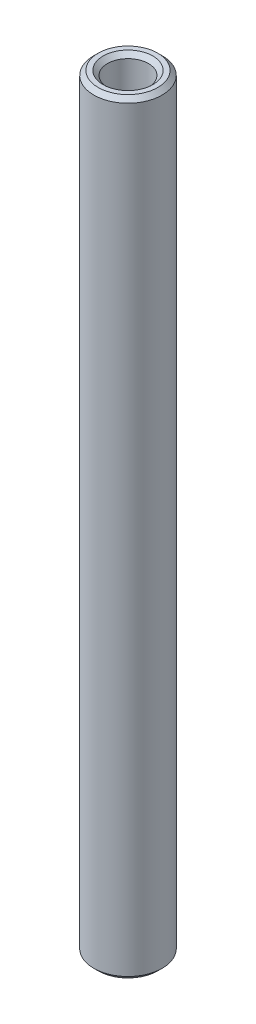
ISO-10303-21;
HEADER;
FILE_DESCRIPTION(('STEP AP214'),'2;1');
FILE_NAME('part.step','',(''),(''),'','','');
FILE_SCHEMA(('AUTOMOTIVE_DESIGN { 1 0 10303 214 1 1 1 1 }'));
ENDSEC;
DATA;
#1=APPLICATION_CONTEXT('core data for automotive mechanical design processes');
#2=APPLICATION_PROTOCOL_DEFINITION('international standard','automotive_design',2000,#1);
#3=PRODUCT_CONTEXT('',#1,'mechanical');
#4=PRODUCT('Part','Part','',(#3));
#5=PRODUCT_RELATED_PRODUCT_CATEGORY('part','',(#4));
#6=PRODUCT_DEFINITION_FORMATION('','',#4);
#7=PRODUCT_DEFINITION_CONTEXT('part definition',#1,'design');
#8=PRODUCT_DEFINITION('design','',#6,#7);
#9=PRODUCT_DEFINITION_SHAPE('','',#8);
#10=(LENGTH_UNIT() NAMED_UNIT(*) SI_UNIT(.MILLI.,.METRE.));
#11=(NAMED_UNIT(*) PLANE_ANGLE_UNIT() SI_UNIT($,.RADIAN.));
#12=(NAMED_UNIT(*) SI_UNIT($,.STERADIAN.) SOLID_ANGLE_UNIT());
#13=UNCERTAINTY_MEASURE_WITH_UNIT(LENGTH_MEASURE(1.E-05),#10,'distance_accuracy_value','');
#14=(GEOMETRIC_REPRESENTATION_CONTEXT(3) GLOBAL_UNCERTAINTY_ASSIGNED_CONTEXT((#13)) GLOBAL_UNIT_ASSIGNED_CONTEXT((#10,
#11,#12)) REPRESENTATION_CONTEXT('',''));
#15=CARTESIAN_POINT('',(0.,0.,0.));
#16=DIRECTION('',(0.,0.,1.));
#17=DIRECTION('',(1.,0.,0.));
#18=AXIS2_PLACEMENT_3D('',#15,#16,#17);
#19=CARTESIAN_POINT('',(0.,22.225,0.));
#20=DIRECTION('',(0.,1.,0.));
#21=DIRECTION('',(0.,0.,1.));
#22=AXIS2_PLACEMENT_3D('',#19,#20,#21);
#23=PLANE('',#22);
#24=CARTESIAN_POINT('',(0.,22.225,0.));
#25=DIRECTION('',(0.,1.,0.));
#26=DIRECTION('',(0.,0.,1.));
#27=AXIS2_PLACEMENT_3D('',#24,#25,#26);
#28=CIRCLE('',#27,1.444625);
#29=CARTESIAN_POINT('',(0.,22.225,1.444625));
#30=VERTEX_POINT('',#29);
#31=EDGE_CURVE('E10',#30,#30,#28,.F.);
#32=ORIENTED_EDGE('',*,*,#31,.T.);
#33=EDGE_LOOP('',(#32));
#34=FACE_BOUND('',#33,.T.);
#35=CARTESIAN_POINT('',(0.,22.225,0.));
#36=DIRECTION('',(0.,1.,0.));
#37=DIRECTION('',(0.,0.,1.));
#38=AXIS2_PLACEMENT_3D('',#35,#36,#37);
#39=CIRCLE('',#38,1.73037499999999);
#40=CARTESIAN_POINT('',(0.,22.225,1.73037499999999));
#41=VERTEX_POINT('',#40);
#42=EDGE_CURVE('E40',#41,#41,#39,.T.);
#43=ORIENTED_EDGE('',*,*,#42,.T.);
#44=EDGE_LOOP('',(#43));
#45=FACE_BOUND('',#44,.T.);
#46=ADVANCED_FACE('F32',(#34,#45),#23,.T.);
#47=CARTESIAN_POINT('',(0.,-22.225,0.));
#48=DIRECTION('',(0.,1.,0.));
#49=DIRECTION('',(0.,0.,1.));
#50=AXIS2_PLACEMENT_3D('',#47,#48,#49);
#51=PLANE('',#50);
#52=CARTESIAN_POINT('',(0.,-22.225,0.));
#53=DIRECTION('',(0.,1.,0.));
#54=DIRECTION('',(0.,0.,1.));
#55=AXIS2_PLACEMENT_3D('',#52,#53,#54);
#56=CIRCLE('',#55,1.444625);
#57=CARTESIAN_POINT('',(0.,-22.225,1.444625));
#58=VERTEX_POINT('',#57);
#59=EDGE_CURVE('E59',#58,#58,#56,.T.);
#60=ORIENTED_EDGE('',*,*,#59,.T.);
#61=EDGE_LOOP('',(#60));
#62=FACE_BOUND('',#61,.T.);
#63=CARTESIAN_POINT('',(0.,-22.225,0.));
#64=DIRECTION('',(0.,1.,0.));
#65=DIRECTION('',(0.,0.,1.));
#66=AXIS2_PLACEMENT_3D('',#63,#64,#65);
#67=CIRCLE('',#66,1.73037499999999);
#68=CARTESIAN_POINT('',(0.,-22.225,1.73037499999999));
#69=VERTEX_POINT('',#68);
#70=EDGE_CURVE('E62',#69,#69,#67,.F.);
#71=ORIENTED_EDGE('',*,*,#70,.T.);
#72=EDGE_LOOP('',(#71));
#73=FACE_BOUND('',#72,.T.);
#74=ADVANCED_FACE('F66',(#62,#73),#51,.F.);
#75=CARTESIAN_POINT('',(0.,22.225,0.));
#76=DIRECTION('',(0.,-1.,0.));
#77=DIRECTION('',(0.,0.,-1.));
#78=AXIS2_PLACEMENT_3D('',#75,#76,#77);
#79=CYLINDRICAL_SURFACE('',#78,1.984375);
#80=CARTESIAN_POINT('',(0.,-21.971,0.));
#81=DIRECTION('',(0.,1.,0.));
#82=DIRECTION('',(0.,0.,1.));
#83=AXIS2_PLACEMENT_3D('',#80,#81,#82);
#84=CIRCLE('',#83,1.984375);
#85=CARTESIAN_POINT('',(0.,-21.971,1.984375));
#86=VERTEX_POINT('',#85);
#87=EDGE_CURVE('E44',#86,#86,#84,.T.);
#88=ORIENTED_EDGE('',*,*,#87,.T.);
#89=EDGE_LOOP('',(#88));
#90=FACE_BOUND('',#89,.T.);
#91=CARTESIAN_POINT('',(0.,21.971,0.));
#92=DIRECTION('',(0.,1.,0.));
#93=DIRECTION('',(0.,0.,1.));
#94=AXIS2_PLACEMENT_3D('',#91,#92,#93);
#95=CIRCLE('',#94,1.984375);
#96=CARTESIAN_POINT('',(0.,21.971,1.984375));
#97=VERTEX_POINT('',#96);
#98=EDGE_CURVE('E48',#97,#97,#95,.F.);
#99=ORIENTED_EDGE('',*,*,#98,.T.);
#100=EDGE_LOOP('',(#99));
#101=FACE_BOUND('',#100,.T.);
#102=ADVANCED_FACE('F76',(#90,#101),#79,.T.);
#103=CARTESIAN_POINT('',(0.,22.225,0.));
#104=DIRECTION('',(0.,-1.,0.));
#105=DIRECTION('',(0.,0.,-1.));
#106=AXIS2_PLACEMENT_3D('',#103,#104,#105);
#107=CYLINDRICAL_SURFACE('',#106,1.190625);
#108=CARTESIAN_POINT('',(0.,-21.971,0.));
#109=DIRECTION('',(0.,1.,0.));
#110=DIRECTION('',(0.,0.,1.));
#111=AXIS2_PLACEMENT_3D('',#108,#109,#110);
#112=CIRCLE('',#111,1.190625);
#113=CARTESIAN_POINT('',(0.,-21.971,1.190625));
#114=VERTEX_POINT('',#113);
#115=EDGE_CURVE('E53',#114,#114,#112,.F.);
#116=ORIENTED_EDGE('',*,*,#115,.T.);
#117=EDGE_LOOP('',(#116));
#118=FACE_BOUND('',#117,.T.);
#119=CARTESIAN_POINT('',(0.,21.971,0.));
#120=DIRECTION('',(0.,1.,0.));
#121=DIRECTION('',(0.,0.,1.));
#122=AXIS2_PLACEMENT_3D('',#119,#120,#121);
#123=CIRCLE('',#122,1.190625);
#124=CARTESIAN_POINT('',(0.,21.971,1.190625));
#125=VERTEX_POINT('',#124);
#126=EDGE_CURVE('E56',#125,#125,#123,.T.);
#127=ORIENTED_EDGE('',*,*,#126,.T.);
#128=EDGE_LOOP('',(#127));
#129=FACE_BOUND('',#128,.T.);
#130=ADVANCED_FACE('F79',(#118,#129),#107,.F.);
#131=CARTESIAN_POINT('',(0.,-22.225,0.));
#132=DIRECTION('',(0.,-1.,0.));
#133=DIRECTION('',(0.,0.,-1.));
#134=AXIS2_PLACEMENT_3D('',#131,#132,#133);
#135=CONICAL_SURFACE('',#134,1.444625,0.78539816339745);
#136=ORIENTED_EDGE('',*,*,#115,.F.);
#137=EDGE_LOOP('',(#136));
#138=FACE_BOUND('',#137,.T.);
#139=ORIENTED_EDGE('',*,*,#59,.F.);
#140=EDGE_LOOP('',(#139));
#141=FACE_BOUND('',#140,.T.);
#142=ADVANCED_FACE('F72',(#138,#141),#135,.F.);
#143=CARTESIAN_POINT('',(0.,-21.971,0.));
#144=DIRECTION('',(0.,1.,0.));
#145=DIRECTION('',(0.,0.,1.));
#146=AXIS2_PLACEMENT_3D('',#143,#144,#145);
#147=CONICAL_SURFACE('',#146,1.984375,0.785398163397455);
#148=ORIENTED_EDGE('',*,*,#70,.F.);
#149=EDGE_LOOP('',(#148));
#150=FACE_BOUND('',#149,.T.);
#151=ORIENTED_EDGE('',*,*,#87,.F.);
#152=EDGE_LOOP('',(#151));
#153=FACE_BOUND('',#152,.T.);
#154=ADVANCED_FACE('F68',(#150,#153),#147,.T.);
#155=CARTESIAN_POINT('',(0.,21.971,0.));
#156=DIRECTION('',(0.,1.,0.));
#157=DIRECTION('',(0.,0.,1.));
#158=AXIS2_PLACEMENT_3D('',#155,#156,#157);
#159=CONICAL_SURFACE('',#158,1.190625,0.785398163397443);
#160=ORIENTED_EDGE('',*,*,#31,.F.);
#161=EDGE_LOOP('',(#160));
#162=FACE_BOUND('',#161,.T.);
#163=ORIENTED_EDGE('',*,*,#126,.F.);
#164=EDGE_LOOP('',(#163));
#165=FACE_BOUND('',#164,.T.);
#166=ADVANCED_FACE('F71',(#162,#165),#159,.F.);
#167=CARTESIAN_POINT('',(0.,22.225,0.));
#168=DIRECTION('',(0.,-1.,0.));
#169=DIRECTION('',(0.,0.,-1.));
#170=AXIS2_PLACEMENT_3D('',#167,#168,#169);
#171=CONICAL_SURFACE('',#170,1.73037499999999,0.785398163397448);
#172=ORIENTED_EDGE('',*,*,#98,.F.);
#173=EDGE_LOOP('',(#172));
#174=FACE_BOUND('',#173,.T.);
#175=ORIENTED_EDGE('',*,*,#42,.F.);
#176=EDGE_LOOP('',(#175));
#177=FACE_BOUND('',#176,.T.);
#178=ADVANCED_FACE('F35',(#174,#177),#171,.T.);
#179=CLOSED_SHELL('',(#46,#74,#102,#130,#142,#154,#166,#178));
#180=MANIFOLD_SOLID_BREP('B2',#179);
#181=ADVANCED_BREP_SHAPE_REPRESENTATION('',(#18,#180),#14);
#182=SHAPE_DEFINITION_REPRESENTATION(#9,#181);
ENDSEC;
END-ISO-10303-21;
